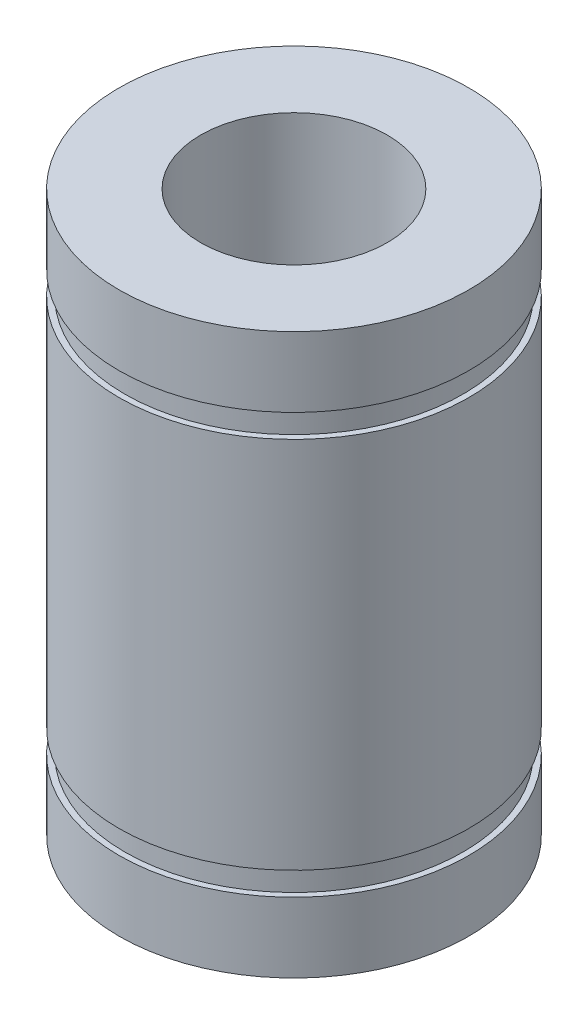
ISO-10303-21;
HEADER;
FILE_DESCRIPTION(('STEP AP214'),'2;1');
FILE_NAME('part.step','',(''),(''),'','','');
FILE_SCHEMA(('AUTOMOTIVE_DESIGN { 1 0 10303 214 1 1 1 1 }'));
ENDSEC;
DATA;
#1=APPLICATION_CONTEXT('core data for automotive mechanical design processes');
#2=APPLICATION_PROTOCOL_DEFINITION('international standard','automotive_design',2000,#1);
#3=PRODUCT_CONTEXT('',#1,'mechanical');
#4=PRODUCT('Part','Part','',(#3));
#5=PRODUCT_RELATED_PRODUCT_CATEGORY('part','',(#4));
#6=PRODUCT_DEFINITION_FORMATION('','',#4);
#7=PRODUCT_DEFINITION_CONTEXT('part definition',#1,'design');
#8=PRODUCT_DEFINITION('design','',#6,#7);
#9=PRODUCT_DEFINITION_SHAPE('','',#8);
#10=(LENGTH_UNIT() NAMED_UNIT(*) SI_UNIT(.MILLI.,.METRE.));
#11=(NAMED_UNIT(*) PLANE_ANGLE_UNIT() SI_UNIT($,.RADIAN.));
#12=(NAMED_UNIT(*) SI_UNIT($,.STERADIAN.) SOLID_ANGLE_UNIT());
#13=UNCERTAINTY_MEASURE_WITH_UNIT(LENGTH_MEASURE(1.E-05),#10,'distance_accuracy_value','');
#14=(GEOMETRIC_REPRESENTATION_CONTEXT(3) GLOBAL_UNCERTAINTY_ASSIGNED_CONTEXT((#13)) GLOBAL_UNIT_ASSIGNED_CONTEXT((#10,
#11,#12)) REPRESENTATION_CONTEXT('',''));
#15=CARTESIAN_POINT('',(0.,0.,0.));
#16=DIRECTION('',(0.,0.,1.));
#17=DIRECTION('',(1.,0.,0.));
#18=AXIS2_PLACEMENT_3D('',#15,#16,#17);
#19=CARTESIAN_POINT('',(0.,0.,0.));
#20=DIRECTION('',(0.,1.,0.));
#21=DIRECTION('',(0.,0.,1.));
#22=AXIS2_PLACEMENT_3D('',#19,#20,#21);
#23=CYLINDRICAL_SURFACE('',#22,7.5);
#24=CARTESIAN_POINT('',(0.,0.,0.));
#25=DIRECTION('',(0.,1.,0.));
#26=DIRECTION('',(0.,0.,1.));
#27=AXIS2_PLACEMENT_3D('',#24,#25,#26);
#28=CIRCLE('',#27,7.5);
#29=CARTESIAN_POINT('',(0.,0.,7.5));
#30=VERTEX_POINT('',#29);
#31=EDGE_CURVE('E72',#30,#30,#28,.T.);
#32=ORIENTED_EDGE('',*,*,#31,.F.);
#33=EDGE_LOOP('',(#32));
#34=FACE_BOUND('',#33,.T.);
#35=CARTESIAN_POINT('',(0.,-3.,0.));
#36=DIRECTION('',(0.,1.,0.));
#37=DIRECTION('',(0.,0.,1.));
#38=AXIS2_PLACEMENT_3D('',#35,#36,#37);
#39=CIRCLE('',#38,7.5);
#40=CARTESIAN_POINT('',(0.,-3.,7.5));
#41=VERTEX_POINT('',#40);
#42=EDGE_CURVE('E10',#41,#41,#39,.T.);
#43=ORIENTED_EDGE('',*,*,#42,.T.);
#44=EDGE_LOOP('',(#43));
#45=FACE_BOUND('',#44,.T.);
#46=ADVANCED_FACE('F32',(#34,#45),#23,.T.);
#47=CARTESIAN_POINT('',(7.5,-3.,0.));
#48=DIRECTION('',(0.,1.,0.));
#49=DIRECTION('',(0.,0.,1.));
#50=AXIS2_PLACEMENT_3D('',#47,#48,#49);
#51=PLANE('',#50);
#52=ORIENTED_EDGE('',*,*,#42,.F.);
#53=EDGE_LOOP('',(#52));
#54=FACE_BOUND('',#53,.T.);
#55=CARTESIAN_POINT('',(0.,-3.,0.));
#56=DIRECTION('',(0.,1.,0.));
#57=DIRECTION('',(0.,0.,1.));
#58=AXIS2_PLACEMENT_3D('',#55,#56,#57);
#59=CIRCLE('',#58,7.25);
#60=CARTESIAN_POINT('',(0.,-3.,7.25));
#61=VERTEX_POINT('',#60);
#62=EDGE_CURVE('E38',#61,#61,#59,.T.);
#63=ORIENTED_EDGE('',*,*,#62,.T.);
#64=EDGE_LOOP('',(#63));
#65=FACE_BOUND('',#64,.T.);
#66=ADVANCED_FACE('F79',(#54,#65),#51,.F.);
#67=CARTESIAN_POINT('',(0.,0.,0.));
#68=DIRECTION('',(0.,1.,0.));
#69=DIRECTION('',(0.,0.,1.));
#70=AXIS2_PLACEMENT_3D('',#67,#68,#69);
#71=CYLINDRICAL_SURFACE('',#70,7.25);
#72=ORIENTED_EDGE('',*,*,#62,.F.);
#73=EDGE_LOOP('',(#72));
#74=FACE_BOUND('',#73,.T.);
#75=CARTESIAN_POINT('',(0.,-4.,0.));
#76=DIRECTION('',(0.,1.,0.));
#77=DIRECTION('',(0.,0.,1.));
#78=AXIS2_PLACEMENT_3D('',#75,#76,#77);
#79=CIRCLE('',#78,7.25);
#80=CARTESIAN_POINT('',(0.,-4.,7.25));
#81=VERTEX_POINT('',#80);
#82=EDGE_CURVE('E42',#81,#81,#79,.T.);
#83=ORIENTED_EDGE('',*,*,#82,.T.);
#84=EDGE_LOOP('',(#83));
#85=FACE_BOUND('',#84,.T.);
#86=ADVANCED_FACE('F83',(#74,#85),#71,.T.);
#87=CARTESIAN_POINT('',(7.25,-4.,0.));
#88=DIRECTION('',(0.,-1.,0.));
#89=DIRECTION('',(0.,0.,-1.));
#90=AXIS2_PLACEMENT_3D('',#87,#88,#89);
#91=PLANE('',#90);
#92=ORIENTED_EDGE('',*,*,#82,.F.);
#93=EDGE_LOOP('',(#92));
#94=FACE_BOUND('',#93,.T.);
#95=CARTESIAN_POINT('',(0.,-4.,0.));
#96=DIRECTION('',(0.,1.,0.));
#97=DIRECTION('',(0.,0.,1.));
#98=AXIS2_PLACEMENT_3D('',#95,#96,#97);
#99=CIRCLE('',#98,7.5);
#100=CARTESIAN_POINT('',(0.,-4.,7.5));
#101=VERTEX_POINT('',#100);
#102=EDGE_CURVE('E46',#101,#101,#99,.T.);
#103=ORIENTED_EDGE('',*,*,#102,.T.);
#104=EDGE_LOOP('',(#103));
#105=FACE_BOUND('',#104,.T.);
#106=ADVANCED_FACE('F88',(#94,#105),#91,.F.);
#107=CARTESIAN_POINT('',(0.,0.,0.));
#108=DIRECTION('',(0.,1.,0.));
#109=DIRECTION('',(0.,0.,1.));
#110=AXIS2_PLACEMENT_3D('',#107,#108,#109);
#111=CYLINDRICAL_SURFACE('',#110,7.5);
#112=ORIENTED_EDGE('',*,*,#102,.F.);
#113=EDGE_LOOP('',(#112));
#114=FACE_BOUND('',#113,.T.);
#115=CARTESIAN_POINT('',(0.,-20.,0.));
#116=DIRECTION('',(0.,1.,0.));
#117=DIRECTION('',(0.,0.,1.));
#118=AXIS2_PLACEMENT_3D('',#115,#116,#117);
#119=CIRCLE('',#118,7.5);
#120=CARTESIAN_POINT('',(0.,-20.,7.5));
#121=VERTEX_POINT('',#120);
#122=EDGE_CURVE('E51',#121,#121,#119,.T.);
#123=ORIENTED_EDGE('',*,*,#122,.T.);
#124=EDGE_LOOP('',(#123));
#125=FACE_BOUND('',#124,.T.);
#126=ADVANCED_FACE('F94',(#114,#125),#111,.T.);
#127=CARTESIAN_POINT('',(7.5,-20.,0.));
#128=DIRECTION('',(0.,1.,0.));
#129=DIRECTION('',(0.,0.,1.));
#130=AXIS2_PLACEMENT_3D('',#127,#128,#129);
#131=PLANE('',#130);
#132=ORIENTED_EDGE('',*,*,#122,.F.);
#133=EDGE_LOOP('',(#132));
#134=FACE_BOUND('',#133,.T.);
#135=CARTESIAN_POINT('',(0.,-20.,0.));
#136=DIRECTION('',(0.,1.,0.));
#137=DIRECTION('',(0.,0.,1.));
#138=AXIS2_PLACEMENT_3D('',#135,#136,#137);
#139=CIRCLE('',#138,7.25);
#140=CARTESIAN_POINT('',(0.,-20.,7.25));
#141=VERTEX_POINT('',#140);
#142=EDGE_CURVE('E54',#141,#141,#139,.T.);
#143=ORIENTED_EDGE('',*,*,#142,.T.);
#144=EDGE_LOOP('',(#143));
#145=FACE_BOUND('',#144,.T.);
#146=ADVANCED_FACE('F98',(#134,#145),#131,.F.);
#147=CARTESIAN_POINT('',(0.,0.,0.));
#148=DIRECTION('',(0.,1.,0.));
#149=DIRECTION('',(0.,0.,1.));
#150=AXIS2_PLACEMENT_3D('',#147,#148,#149);
#151=CYLINDRICAL_SURFACE('',#150,7.25);
#152=ORIENTED_EDGE('',*,*,#142,.F.);
#153=EDGE_LOOP('',(#152));
#154=FACE_BOUND('',#153,.T.);
#155=CARTESIAN_POINT('',(0.,-21.,0.));
#156=DIRECTION('',(0.,1.,0.));
#157=DIRECTION('',(0.,0.,1.));
#158=AXIS2_PLACEMENT_3D('',#155,#156,#157);
#159=CIRCLE('',#158,7.25);
#160=CARTESIAN_POINT('',(0.,-21.,7.25));
#161=VERTEX_POINT('',#160);
#162=EDGE_CURVE('E57',#161,#161,#159,.T.);
#163=ORIENTED_EDGE('',*,*,#162,.T.);
#164=EDGE_LOOP('',(#163));
#165=FACE_BOUND('',#164,.T.);
#166=ADVANCED_FACE('F102',(#154,#165),#151,.T.);
#167=CARTESIAN_POINT('',(7.25,-21.,0.));
#168=DIRECTION('',(0.,-1.,0.));
#169=DIRECTION('',(0.,0.,-1.));
#170=AXIS2_PLACEMENT_3D('',#167,#168,#169);
#171=PLANE('',#170);
#172=ORIENTED_EDGE('',*,*,#162,.F.);
#173=EDGE_LOOP('',(#172));
#174=FACE_BOUND('',#173,.T.);
#175=CARTESIAN_POINT('',(0.,-21.,0.));
#176=DIRECTION('',(0.,1.,0.));
#177=DIRECTION('',(0.,0.,1.));
#178=AXIS2_PLACEMENT_3D('',#175,#176,#177);
#179=CIRCLE('',#178,7.5);
#180=CARTESIAN_POINT('',(0.,-21.,7.5));
#181=VERTEX_POINT('',#180);
#182=EDGE_CURVE('E60',#181,#181,#179,.T.);
#183=ORIENTED_EDGE('',*,*,#182,.T.);
#184=EDGE_LOOP('',(#183));
#185=FACE_BOUND('',#184,.T.);
#186=ADVANCED_FACE('F106',(#174,#185),#171,.F.);
#187=CARTESIAN_POINT('',(0.,0.,0.));
#188=DIRECTION('',(0.,1.,0.));
#189=DIRECTION('',(0.,0.,1.));
#190=AXIS2_PLACEMENT_3D('',#187,#188,#189);
#191=CYLINDRICAL_SURFACE('',#190,7.5);
#192=ORIENTED_EDGE('',*,*,#182,.F.);
#193=EDGE_LOOP('',(#192));
#194=FACE_BOUND('',#193,.T.);
#195=CARTESIAN_POINT('',(0.,-24.,0.));
#196=DIRECTION('',(0.,1.,0.));
#197=DIRECTION('',(0.,0.,1.));
#198=AXIS2_PLACEMENT_3D('',#195,#196,#197);
#199=CIRCLE('',#198,7.5);
#200=CARTESIAN_POINT('',(0.,-24.,7.5));
#201=VERTEX_POINT('',#200);
#202=EDGE_CURVE('E63',#201,#201,#199,.T.);
#203=ORIENTED_EDGE('',*,*,#202,.T.);
#204=EDGE_LOOP('',(#203));
#205=FACE_BOUND('',#204,.T.);
#206=ADVANCED_FACE('F110',(#194,#205),#191,.T.);
#207=CARTESIAN_POINT('',(7.5,-24.,0.));
#208=DIRECTION('',(0.,1.,0.));
#209=DIRECTION('',(0.,0.,1.));
#210=AXIS2_PLACEMENT_3D('',#207,#208,#209);
#211=PLANE('',#210);
#212=ORIENTED_EDGE('',*,*,#202,.F.);
#213=EDGE_LOOP('',(#212));
#214=FACE_BOUND('',#213,.T.);
#215=CARTESIAN_POINT('',(0.,-24.,0.));
#216=DIRECTION('',(0.,1.,0.));
#217=DIRECTION('',(0.,0.,1.));
#218=AXIS2_PLACEMENT_3D('',#215,#216,#217);
#219=CIRCLE('',#218,4.00000000000001);
#220=CARTESIAN_POINT('',(0.,-24.,4.00000000000001));
#221=VERTEX_POINT('',#220);
#222=EDGE_CURVE('E66',#221,#221,#219,.T.);
#223=ORIENTED_EDGE('',*,*,#222,.T.);
#224=EDGE_LOOP('',(#223));
#225=FACE_BOUND('',#224,.T.);
#226=ADVANCED_FACE('F114',(#214,#225),#211,.F.);
#227=CARTESIAN_POINT('',(0.,0.,0.));
#228=DIRECTION('',(0.,1.,0.));
#229=DIRECTION('',(0.,0.,1.));
#230=AXIS2_PLACEMENT_3D('',#227,#228,#229);
#231=CYLINDRICAL_SURFACE('',#230,4.00000000000001);
#232=ORIENTED_EDGE('',*,*,#222,.F.);
#233=EDGE_LOOP('',(#232));
#234=FACE_BOUND('',#233,.T.);
#235=CARTESIAN_POINT('',(0.,0.,0.));
#236=DIRECTION('',(0.,1.,0.));
#237=DIRECTION('',(0.,0.,1.));
#238=AXIS2_PLACEMENT_3D('',#235,#236,#237);
#239=CIRCLE('',#238,4.00000000000001);
#240=CARTESIAN_POINT('',(0.,0.,4.00000000000001));
#241=VERTEX_POINT('',#240);
#242=EDGE_CURVE('E69',#241,#241,#239,.T.);
#243=ORIENTED_EDGE('',*,*,#242,.T.);
#244=EDGE_LOOP('',(#243));
#245=FACE_BOUND('',#244,.T.);
#246=ADVANCED_FACE('F118',(#234,#245),#231,.F.);
#247=CARTESIAN_POINT('',(4.00000000000001,0.,0.));
#248=DIRECTION('',(0.,-1.,0.));
#249=DIRECTION('',(0.,0.,-1.));
#250=AXIS2_PLACEMENT_3D('',#247,#248,#249);
#251=PLANE('',#250);
#252=ORIENTED_EDGE('',*,*,#242,.F.);
#253=EDGE_LOOP('',(#252));
#254=FACE_BOUND('',#253,.T.);
#255=ORIENTED_EDGE('',*,*,#31,.T.);
#256=EDGE_LOOP('',(#255));
#257=FACE_BOUND('',#256,.T.);
#258=ADVANCED_FACE('F76',(#254,#257),#251,.F.);
#259=CLOSED_SHELL('',(#46,#66,#86,#106,#126,#146,#166,#186,#206,#226,#246,#258));
#260=MANIFOLD_SOLID_BREP('B2',#259);
#261=ADVANCED_BREP_SHAPE_REPRESENTATION('',(#18,#260),#14);
#262=SHAPE_DEFINITION_REPRESENTATION(#9,#261);
ENDSEC;
END-ISO-10303-21;
